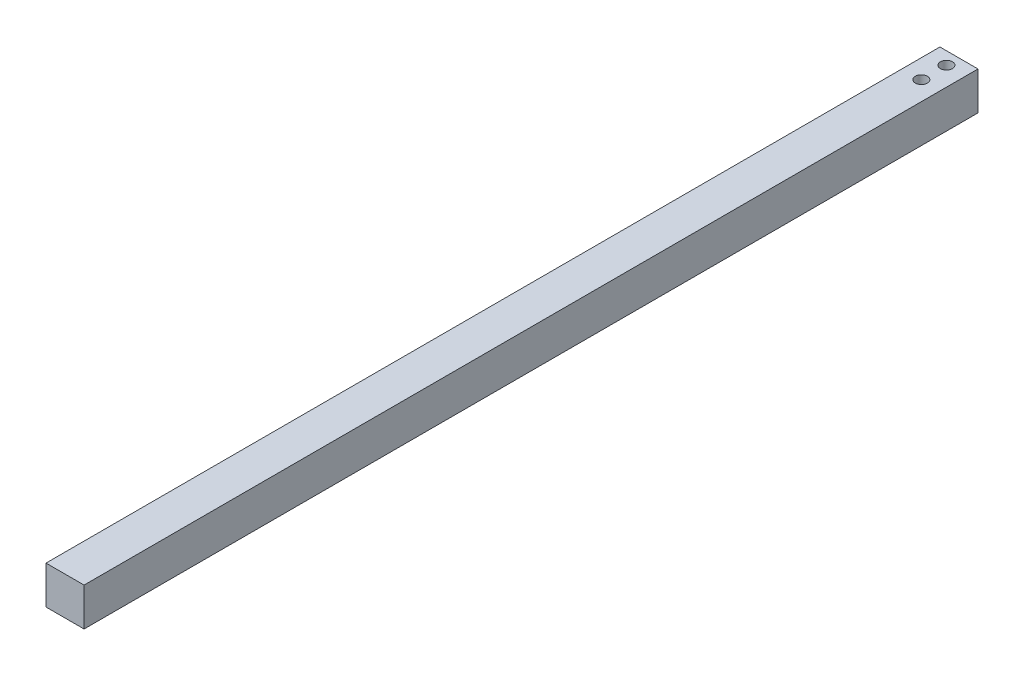
ISO-10303-21;
HEADER;
FILE_DESCRIPTION(('STEP AP214'),'2;1');
FILE_NAME('part.step','',(''),(''),'','','');
FILE_SCHEMA(('AUTOMOTIVE_DESIGN { 1 0 10303 214 1 1 1 1 }'));
ENDSEC;
DATA;
#1=APPLICATION_CONTEXT('core data for automotive mechanical design processes');
#2=APPLICATION_PROTOCOL_DEFINITION('international standard','automotive_design',2000,#1);
#3=PRODUCT_CONTEXT('',#1,'mechanical');
#4=PRODUCT('Part','Part','',(#3));
#5=PRODUCT_RELATED_PRODUCT_CATEGORY('part','',(#4));
#6=PRODUCT_DEFINITION_FORMATION('','',#4);
#7=PRODUCT_DEFINITION_CONTEXT('part definition',#1,'design');
#8=PRODUCT_DEFINITION('design','',#6,#7);
#9=PRODUCT_DEFINITION_SHAPE('','',#8);
#10=(LENGTH_UNIT() NAMED_UNIT(*) SI_UNIT(.MILLI.,.METRE.));
#11=(NAMED_UNIT(*) PLANE_ANGLE_UNIT() SI_UNIT($,.RADIAN.));
#12=(NAMED_UNIT(*) SI_UNIT($,.STERADIAN.) SOLID_ANGLE_UNIT());
#13=UNCERTAINTY_MEASURE_WITH_UNIT(LENGTH_MEASURE(1.E-05),#10,'distance_accuracy_value','');
#14=(GEOMETRIC_REPRESENTATION_CONTEXT(3) GLOBAL_UNCERTAINTY_ASSIGNED_CONTEXT((#13)) GLOBAL_UNIT_ASSIGNED_CONTEXT((#10,
#11,#12)) REPRESENTATION_CONTEXT('',''));
#15=CARTESIAN_POINT('',(0.,0.,0.));
#16=DIRECTION('',(0.,0.,1.));
#17=DIRECTION('',(1.,0.,0.));
#18=AXIS2_PLACEMENT_3D('',#15,#16,#17);
#19=CARTESIAN_POINT('',(-9.5,-9.5,446.));
#20=DIRECTION('',(0.,1.,0.));
#21=DIRECTION('',(0.,0.,1.));
#22=AXIS2_PLACEMENT_3D('',#19,#20,#21);
#23=PLANE('',#22);
#24=CARTESIAN_POINT('',(0.,-9.5,18.75));
#25=DIRECTION('',(0.,1.,0.));
#26=DIRECTION('',(0.,0.,1.));
#27=AXIS2_PLACEMENT_3D('',#24,#25,#26);
#28=CIRCLE('',#27,3.);
#29=CARTESIAN_POINT('',(0.,-9.5,21.75));
#30=VERTEX_POINT('',#29);
#31=EDGE_CURVE('E117',#30,#30,#28,.T.);
#32=ORIENTED_EDGE('',*,*,#31,.T.);
#33=EDGE_LOOP('',(#32));
#34=FACE_BOUND('',#33,.T.);
#35=CARTESIAN_POINT('',(5.99999999999999,-9.5,442.25));
#36=DIRECTION('',(0.,-1.,0.));
#37=DIRECTION('',(0.,0.,-1.));
#38=AXIS2_PLACEMENT_3D('',#35,#36,#37);
#39=CIRCLE('',#38,1.99999999999999);
#40=CARTESIAN_POINT('',(5.99999999999999,-9.5,440.25));
#41=VERTEX_POINT('',#40);
#42=EDGE_CURVE('E115',#41,#41,#39,.T.);
#43=ORIENTED_EDGE('',*,*,#42,.F.);
#44=EDGE_LOOP('',(#43));
#45=FACE_BOUND('',#44,.T.);
#46=DIRECTION('',(1.,0.,0.));
#47=VECTOR('',#46,1.);
#48=CARTESIAN_POINT('',(-9.5,-9.5,0.));
#49=LINE('',#48,#47);
#50=CARTESIAN_POINT('',(-9.5,-9.5,0.));
#51=VERTEX_POINT('',#50);
#52=CARTESIAN_POINT('',(9.5,-9.5,0.));
#53=VERTEX_POINT('',#52);
#54=EDGE_CURVE('E75',#51,#53,#49,.T.);
#55=ORIENTED_EDGE('',*,*,#54,.T.);
#56=DIRECTION('',(0.,0.,-1.));
#57=VECTOR('',#56,1.);
#58=CARTESIAN_POINT('',(9.5,-9.5,446.));
#59=LINE('',#58,#57);
#60=CARTESIAN_POINT('',(9.5,-9.5,446.));
#61=VERTEX_POINT('',#60);
#62=EDGE_CURVE('E97',#61,#53,#59,.T.);
#63=ORIENTED_EDGE('',*,*,#62,.F.);
#64=DIRECTION('',(1.,0.,0.));
#65=VECTOR('',#64,1.);
#66=CARTESIAN_POINT('',(-9.5,-9.5,446.));
#67=LINE('',#66,#65);
#68=CARTESIAN_POINT('',(-9.5,-9.5,446.));
#69=VERTEX_POINT('',#68);
#70=EDGE_CURVE('E52',#69,#61,#67,.T.);
#71=ORIENTED_EDGE('',*,*,#70,.F.);
#72=DIRECTION('',(0.,0.,-1.));
#73=VECTOR('',#72,1.);
#74=CARTESIAN_POINT('',(-9.5,-9.5,446.));
#75=LINE('',#74,#73);
#76=EDGE_CURVE('E93',#69,#51,#75,.T.);
#77=ORIENTED_EDGE('',*,*,#76,.T.);
#78=EDGE_LOOP('',(#55,#63,#71,#77));
#79=FACE_BOUND('',#78,.T.);
#80=CARTESIAN_POINT('',(-6.00000000000001,-9.5,442.25));
#81=DIRECTION('',(0.,-1.,0.));
#82=DIRECTION('',(0.,0.,-1.));
#83=AXIS2_PLACEMENT_3D('',#80,#81,#82);
#84=CIRCLE('',#83,1.99999999999999);
#85=CARTESIAN_POINT('',(-6.00000000000001,-9.5,440.25));
#86=VERTEX_POINT('',#85);
#87=EDGE_CURVE('E126',#86,#86,#84,.F.);
#88=ORIENTED_EDGE('',*,*,#87,.T.);
#89=EDGE_LOOP('',(#88));
#90=FACE_BOUND('',#89,.T.);
#91=CARTESIAN_POINT('',(0.,-9.5,6.25));
#92=DIRECTION('',(0.,1.,0.));
#93=DIRECTION('',(0.,0.,1.));
#94=AXIS2_PLACEMENT_3D('',#91,#92,#93);
#95=CIRCLE('',#94,3.);
#96=CARTESIAN_POINT('',(0.,-9.5,9.24999999999999));
#97=VERTEX_POINT('',#96);
#98=EDGE_CURVE('E111',#97,#97,#95,.F.);
#99=ORIENTED_EDGE('',*,*,#98,.F.);
#100=EDGE_LOOP('',(#99));
#101=FACE_BOUND('',#100,.T.);
#102=ADVANCED_FACE('F33',(#34,#45,#79,#90,#101),#23,.F.);
#103=CARTESIAN_POINT('',(-9.5,9.5,446.));
#104=DIRECTION('',(0.,-1.,0.));
#105=DIRECTION('',(0.,0.,-1.));
#106=AXIS2_PLACEMENT_3D('',#103,#104,#105);
#107=PLANE('',#106);
#108=CARTESIAN_POINT('',(0.,9.5,18.75));
#109=DIRECTION('',(0.,-1.,0.));
#110=DIRECTION('',(0.,0.,-1.));
#111=AXIS2_PLACEMENT_3D('',#108,#109,#110);
#112=CIRCLE('',#111,3.);
#113=CARTESIAN_POINT('',(0.,9.5,15.75));
#114=VERTEX_POINT('',#113);
#115=EDGE_CURVE('E109',#114,#114,#112,.T.);
#116=ORIENTED_EDGE('',*,*,#115,.T.);
#117=EDGE_LOOP('',(#116));
#118=FACE_BOUND('',#117,.T.);
#119=DIRECTION('',(-1.,0.,0.));
#120=VECTOR('',#119,1.);
#121=CARTESIAN_POINT('',(-9.5,9.5,0.));
#122=LINE('',#121,#120);
#123=CARTESIAN_POINT('',(9.5,9.5,0.));
#124=VERTEX_POINT('',#123);
#125=CARTESIAN_POINT('',(-9.5,9.5,0.));
#126=VERTEX_POINT('',#125);
#127=EDGE_CURVE('E92',#124,#126,#122,.T.);
#128=ORIENTED_EDGE('',*,*,#127,.T.);
#129=DIRECTION('',(0.,0.,-1.));
#130=VECTOR('',#129,1.);
#131=CARTESIAN_POINT('',(-9.5,9.5,446.));
#132=LINE('',#131,#130);
#133=CARTESIAN_POINT('',(-9.5,9.5,446.));
#134=VERTEX_POINT('',#133);
#135=EDGE_CURVE('E43',#134,#126,#132,.T.);
#136=ORIENTED_EDGE('',*,*,#135,.F.);
#137=DIRECTION('',(-1.,0.,0.));
#138=VECTOR('',#137,1.);
#139=CARTESIAN_POINT('',(-9.5,9.5,446.));
#140=LINE('',#139,#138);
#141=CARTESIAN_POINT('',(9.5,9.5,446.));
#142=VERTEX_POINT('',#141);
#143=EDGE_CURVE('E82',#142,#134,#140,.T.);
#144=ORIENTED_EDGE('',*,*,#143,.F.);
#145=DIRECTION('',(0.,0.,-1.));
#146=VECTOR('',#145,1.);
#147=CARTESIAN_POINT('',(9.5,9.5,446.));
#148=LINE('',#147,#146);
#149=EDGE_CURVE('E11',#142,#124,#148,.T.);
#150=ORIENTED_EDGE('',*,*,#149,.T.);
#151=EDGE_LOOP('',(#128,#136,#144,#150));
#152=FACE_BOUND('',#151,.T.);
#153=CARTESIAN_POINT('',(0.,9.5,6.25));
#154=DIRECTION('',(0.,-1.,0.));
#155=DIRECTION('',(0.,0.,-1.));
#156=AXIS2_PLACEMENT_3D('',#153,#154,#155);
#157=CIRCLE('',#156,3.);
#158=CARTESIAN_POINT('',(0.,9.5,3.25));
#159=VERTEX_POINT('',#158);
#160=EDGE_CURVE('E37',#159,#159,#157,.F.);
#161=ORIENTED_EDGE('',*,*,#160,.F.);
#162=EDGE_LOOP('',(#161));
#163=FACE_BOUND('',#162,.T.);
#164=ADVANCED_FACE('F90',(#118,#152,#163),#107,.F.);
#165=CARTESIAN_POINT('',(9.5,-9.5,446.));
#166=DIRECTION('',(-1.,0.,0.));
#167=DIRECTION('',(0.,0.,1.));
#168=AXIS2_PLACEMENT_3D('',#165,#166,#167);
#169=PLANE('',#168);
#170=DIRECTION('',(0.,1.,0.));
#171=VECTOR('',#170,1.);
#172=CARTESIAN_POINT('',(9.5,-9.5,0.));
#173=LINE('',#172,#171);
#174=EDGE_CURVE('E101',#53,#124,#173,.T.);
#175=ORIENTED_EDGE('',*,*,#174,.T.);
#176=ORIENTED_EDGE('',*,*,#149,.F.);
#177=DIRECTION('',(0.,1.,0.));
#178=VECTOR('',#177,1.);
#179=CARTESIAN_POINT('',(9.5,-9.5,446.));
#180=LINE('',#179,#178);
#181=EDGE_CURVE('E87',#61,#142,#180,.T.);
#182=ORIENTED_EDGE('',*,*,#181,.F.);
#183=ORIENTED_EDGE('',*,*,#62,.T.);
#184=EDGE_LOOP('',(#175,#176,#182,#183));
#185=FACE_BOUND('',#184,.T.);
#186=ADVANCED_FACE('F35',(#185),#169,.F.);
#187=CARTESIAN_POINT('',(-9.5,-9.5,446.));
#188=DIRECTION('',(1.,0.,0.));
#189=DIRECTION('',(0.,0.,-1.));
#190=AXIS2_PLACEMENT_3D('',#187,#188,#189);
#191=PLANE('',#190);
#192=DIRECTION('',(0.,-1.,0.));
#193=VECTOR('',#192,1.);
#194=CARTESIAN_POINT('',(-9.5,-9.5,0.));
#195=LINE('',#194,#193);
#196=EDGE_CURVE('E69',#126,#51,#195,.T.);
#197=ORIENTED_EDGE('',*,*,#196,.T.);
#198=ORIENTED_EDGE('',*,*,#76,.F.);
#199=DIRECTION('',(0.,-1.,0.));
#200=VECTOR('',#199,1.);
#201=CARTESIAN_POINT('',(-9.5,-9.5,446.));
#202=LINE('',#201,#200);
#203=EDGE_CURVE('E85',#134,#69,#202,.T.);
#204=ORIENTED_EDGE('',*,*,#203,.F.);
#205=ORIENTED_EDGE('',*,*,#135,.T.);
#206=EDGE_LOOP('',(#197,#198,#204,#205));
#207=FACE_BOUND('',#206,.T.);
#208=ADVANCED_FACE('F95',(#207),#191,.F.);
#209=CARTESIAN_POINT('',(0.,0.,446.));
#210=DIRECTION('',(0.,0.,-1.));
#211=DIRECTION('',(-1.,0.,0.));
#212=AXIS2_PLACEMENT_3D('',#209,#210,#211);
#213=PLANE('',#212);
#214=ORIENTED_EDGE('',*,*,#181,.T.);
#215=ORIENTED_EDGE('',*,*,#143,.T.);
#216=ORIENTED_EDGE('',*,*,#203,.T.);
#217=ORIENTED_EDGE('',*,*,#70,.T.);
#218=EDGE_LOOP('',(#214,#215,#216,#217));
#219=FACE_BOUND('',#218,.T.);
#220=ADVANCED_FACE('F83',(#219),#213,.F.);
#221=CARTESIAN_POINT('',(0.,0.,0.));
#222=DIRECTION('',(0.,0.,-1.));
#223=DIRECTION('',(-1.,0.,0.));
#224=AXIS2_PLACEMENT_3D('',#221,#222,#223);
#225=PLANE('',#224);
#226=ORIENTED_EDGE('',*,*,#174,.F.);
#227=ORIENTED_EDGE('',*,*,#54,.F.);
#228=ORIENTED_EDGE('',*,*,#196,.F.);
#229=ORIENTED_EDGE('',*,*,#127,.F.);
#230=EDGE_LOOP('',(#226,#227,#228,#229));
#231=FACE_BOUND('',#230,.T.);
#232=ADVANCED_FACE('F163',(#231),#225,.T.);
#233=CARTESIAN_POINT('',(5.99999999999999,-0.5,442.25));
#234=DIRECTION('',(0.,-1.,0.));
#235=DIRECTION('',(0.,0.,-1.));
#236=AXIS2_PLACEMENT_3D('',#233,#234,#235);
#237=CYLINDRICAL_SURFACE('',#236,1.99999999999999);
#238=CARTESIAN_POINT('',(5.99999999999999,-0.5,442.25));
#239=DIRECTION('',(0.,-1.,0.));
#240=DIRECTION('',(0.,0.,-1.));
#241=AXIS2_PLACEMENT_3D('',#238,#239,#240);
#242=CIRCLE('',#241,1.99999999999999);
#243=CARTESIAN_POINT('',(5.99999999999999,-0.5,440.25));
#244=VERTEX_POINT('',#243);
#245=EDGE_CURVE('E129',#244,#244,#242,.T.);
#246=ORIENTED_EDGE('',*,*,#245,.F.);
#247=EDGE_LOOP('',(#246));
#248=FACE_BOUND('',#247,.T.);
#249=ORIENTED_EDGE('',*,*,#42,.T.);
#250=EDGE_LOOP('',(#249));
#251=FACE_BOUND('',#250,.T.);
#252=ADVANCED_FACE('F135',(#248,#251),#237,.F.);
#253=CARTESIAN_POINT('',(0.,-0.5,0.));
#254=DIRECTION('',(0.,-1.,0.));
#255=DIRECTION('',(0.,0.,-1.));
#256=AXIS2_PLACEMENT_3D('',#253,#254,#255);
#257=PLANE('',#256);
#258=ORIENTED_EDGE('',*,*,#245,.T.);
#259=EDGE_LOOP('',(#258));
#260=FACE_BOUND('',#259,.T.);
#261=ADVANCED_FACE('F147',(#260),#257,.T.);
#262=CARTESIAN_POINT('',(-6.00000000000001,-0.5,442.25));
#263=DIRECTION('',(0.,-1.,0.));
#264=DIRECTION('',(0.,0.,-1.));
#265=AXIS2_PLACEMENT_3D('',#262,#263,#264);
#266=CYLINDRICAL_SURFACE('',#265,1.99999999999999);
#267=CARTESIAN_POINT('',(-6.00000000000001,-0.5,442.25));
#268=DIRECTION('',(0.,-1.,0.));
#269=DIRECTION('',(0.,0.,-1.));
#270=AXIS2_PLACEMENT_3D('',#267,#268,#269);
#271=CIRCLE('',#270,1.99999999999999);
#272=CARTESIAN_POINT('',(-6.00000000000001,-0.5,440.25));
#273=VERTEX_POINT('',#272);
#274=EDGE_CURVE('E104',#273,#273,#271,.F.);
#275=ORIENTED_EDGE('',*,*,#274,.T.);
#276=EDGE_LOOP('',(#275));
#277=FACE_BOUND('',#276,.T.);
#278=ORIENTED_EDGE('',*,*,#87,.F.);
#279=EDGE_LOOP('',(#278));
#280=FACE_BOUND('',#279,.T.);
#281=ADVANCED_FACE('F144',(#277,#280),#266,.F.);
#282=CARTESIAN_POINT('',(0.,-0.5,0.));
#283=DIRECTION('',(0.,-1.,0.));
#284=DIRECTION('',(0.,0.,-1.));
#285=AXIS2_PLACEMENT_3D('',#282,#283,#284);
#286=PLANE('',#285);
#287=ORIENTED_EDGE('',*,*,#274,.F.);
#288=EDGE_LOOP('',(#287));
#289=FACE_BOUND('',#288,.T.);
#290=ADVANCED_FACE('F146',(#289),#286,.T.);
#291=CARTESIAN_POINT('',(0.,-9.5,18.75));
#292=DIRECTION('',(0.,1.,0.));
#293=DIRECTION('',(0.,0.,1.));
#294=AXIS2_PLACEMENT_3D('',#291,#292,#293);
#295=CYLINDRICAL_SURFACE('',#294,3.);
#296=ORIENTED_EDGE('',*,*,#31,.F.);
#297=EDGE_LOOP('',(#296));
#298=FACE_BOUND('',#297,.T.);
#299=ORIENTED_EDGE('',*,*,#115,.F.);
#300=EDGE_LOOP('',(#299));
#301=FACE_BOUND('',#300,.T.);
#302=ADVANCED_FACE('F154',(#298,#301),#295,.F.);
#303=CARTESIAN_POINT('',(0.,-9.5,6.25));
#304=DIRECTION('',(0.,1.,0.));
#305=DIRECTION('',(0.,0.,1.));
#306=AXIS2_PLACEMENT_3D('',#303,#304,#305);
#307=CYLINDRICAL_SURFACE('',#306,3.);
#308=ORIENTED_EDGE('',*,*,#98,.T.);
#309=EDGE_LOOP('',(#308));
#310=FACE_BOUND('',#309,.T.);
#311=ORIENTED_EDGE('',*,*,#160,.T.);
#312=EDGE_LOOP('',(#311));
#313=FACE_BOUND('',#312,.T.);
#314=ADVANCED_FACE('F230',(#310,#313),#307,.F.);
#315=CLOSED_SHELL('',(#102,#164,#186,#208,#220,#232,#252,#261,#281,#290,#302,#314));
#316=MANIFOLD_SOLID_BREP('B2',#315);
#317=ADVANCED_BREP_SHAPE_REPRESENTATION('',(#18,#316),#14);
#318=SHAPE_DEFINITION_REPRESENTATION(#9,#317);
ENDSEC;
END-ISO-10303-21;
